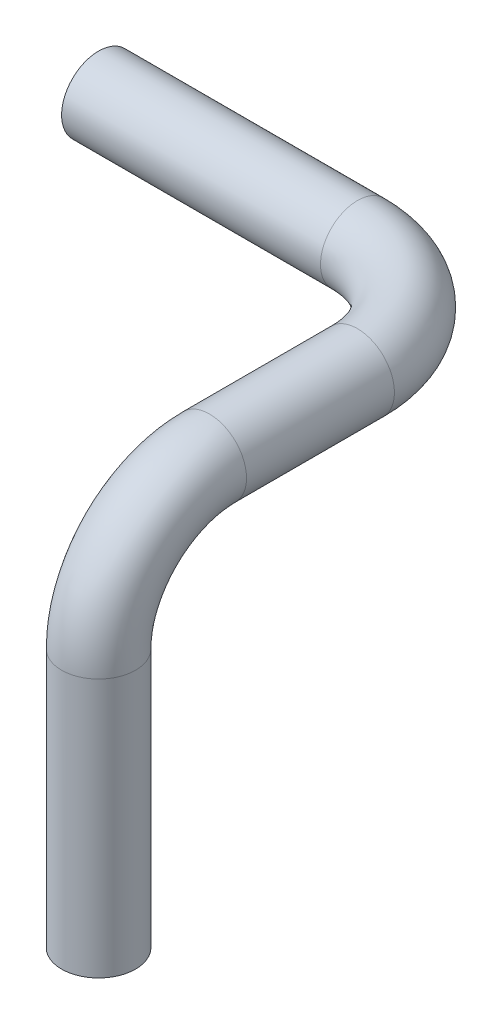
ISO-10303-21;
HEADER;
FILE_DESCRIPTION(('STEP AP214'),'2;1');
FILE_NAME('part.step','',(''),(''),'','','');
FILE_SCHEMA(('AUTOMOTIVE_DESIGN { 1 0 10303 214 1 1 1 1 }'));
ENDSEC;
DATA;
#1=APPLICATION_CONTEXT('core data for automotive mechanical design processes');
#2=APPLICATION_PROTOCOL_DEFINITION('international standard','automotive_design',2000,#1);
#3=PRODUCT_CONTEXT('',#1,'mechanical');
#4=PRODUCT('Part','Part','',(#3));
#5=PRODUCT_RELATED_PRODUCT_CATEGORY('part','',(#4));
#6=PRODUCT_DEFINITION_FORMATION('','',#4);
#7=PRODUCT_DEFINITION_CONTEXT('part definition',#1,'design');
#8=PRODUCT_DEFINITION('design','',#6,#7);
#9=PRODUCT_DEFINITION_SHAPE('','',#8);
#10=(LENGTH_UNIT() NAMED_UNIT(*) SI_UNIT(.MILLI.,.METRE.));
#11=(NAMED_UNIT(*) PLANE_ANGLE_UNIT() SI_UNIT($,.RADIAN.));
#12=(NAMED_UNIT(*) SI_UNIT($,.STERADIAN.) SOLID_ANGLE_UNIT());
#13=UNCERTAINTY_MEASURE_WITH_UNIT(LENGTH_MEASURE(1.E-05),#10,'distance_accuracy_value','');
#14=(GEOMETRIC_REPRESENTATION_CONTEXT(3) GLOBAL_UNCERTAINTY_ASSIGNED_CONTEXT((#13)) GLOBAL_UNIT_ASSIGNED_CONTEXT((#10,
#11,#12)) REPRESENTATION_CONTEXT('',''));
#15=CARTESIAN_POINT('',(0.,0.,0.));
#16=DIRECTION('',(0.,0.,1.));
#17=DIRECTION('',(1.,0.,0.));
#18=AXIS2_PLACEMENT_3D('',#15,#16,#17);
#19=CARTESIAN_POINT('',(0.,254.,0.));
#20=DIRECTION('',(1.,0.,0.));
#21=DIRECTION('',(0.,0.,-1.));
#22=AXIS2_PLACEMENT_3D('',#19,#20,#21);
#23=PLANE('',#22);
#24=CARTESIAN_POINT('',(0.,254.,0.));
#25=DIRECTION('',(1.,0.,0.));
#26=DIRECTION('',(0.,0.,-1.));
#27=AXIS2_PLACEMENT_3D('',#24,#25,#26);
#28=CIRCLE('',#27,22.86);
#29=CARTESIAN_POINT('',(0.,254.,-22.86));
#30=VERTEX_POINT('',#29);
#31=EDGE_CURVE('E99',#30,#30,#28,.T.);
#32=ORIENTED_EDGE('',*,*,#31,.T.);
#33=EDGE_LOOP('',(#32));
#34=FACE_BOUND('',#33,.T.);
#35=CARTESIAN_POINT('',(0.,254.,0.));
#36=DIRECTION('',(1.,0.,0.));
#37=DIRECTION('',(0.,0.,-1.));
#38=AXIS2_PLACEMENT_3D('',#35,#36,#37);
#39=CIRCLE('',#38,25.4);
#40=CARTESIAN_POINT('',(0.,254.,-25.4));
#41=VERTEX_POINT('',#40);
#42=EDGE_CURVE('E64',#41,#41,#39,.T.);
#43=ORIENTED_EDGE('',*,*,#42,.F.);
#44=EDGE_LOOP('',(#43));
#45=FACE_BOUND('',#44,.T.);
#46=ADVANCED_FACE('F51',(#34,#45),#23,.F.);
#47=CARTESIAN_POINT('',(254.,0.,254.));
#48=DIRECTION('',(0.,-1.,0.));
#49=DIRECTION('',(1.,0.,0.));
#50=AXIS2_PLACEMENT_3D('',#47,#48,#49);
#51=PLANE('',#50);
#52=CARTESIAN_POINT('',(254.,0.,254.));
#53=DIRECTION('',(0.,-1.,0.));
#54=DIRECTION('',(0.,0.,-1.));
#55=AXIS2_PLACEMENT_3D('',#52,#53,#54);
#56=CIRCLE('',#55,22.86);
#57=CARTESIAN_POINT('',(254.,0.,231.14));
#58=VERTEX_POINT('',#57);
#59=EDGE_CURVE('E94',#58,#58,#56,.T.);
#60=ORIENTED_EDGE('',*,*,#59,.F.);
#61=EDGE_LOOP('',(#60));
#62=FACE_BOUND('',#61,.T.);
#63=CARTESIAN_POINT('',(254.,0.,254.));
#64=DIRECTION('',(0.,-1.,0.));
#65=DIRECTION('',(1.,0.,0.));
#66=AXIS2_PLACEMENT_3D('',#63,#64,#65);
#67=CIRCLE('',#66,25.4);
#68=CARTESIAN_POINT('',(279.4,0.,254.));
#69=VERTEX_POINT('',#68);
#70=EDGE_CURVE('E12',#69,#69,#67,.T.);
#71=ORIENTED_EDGE('',*,*,#70,.T.);
#72=EDGE_LOOP('',(#71));
#73=FACE_BOUND('',#72,.T.);
#74=ADVANCED_FACE('F67',(#62,#73),#51,.T.);
#75=CARTESIAN_POINT('',(0.,254.,0.));
#76=DIRECTION('',(1.,0.,0.));
#77=DIRECTION('',(0.,0.,-1.));
#78=AXIS2_PLACEMENT_3D('',#75,#76,#77);
#79=CYLINDRICAL_SURFACE('',#78,25.4);
#80=CARTESIAN_POINT('',(177.8,254.,0.));
#81=DIRECTION('',(1.,0.,0.));
#82=DIRECTION('',(0.,0.,-1.));
#83=AXIS2_PLACEMENT_3D('',#80,#81,#82);
#84=CIRCLE('',#83,25.4);
#85=CARTESIAN_POINT('',(177.8,254.,-25.4));
#86=VERTEX_POINT('',#85);
#87=EDGE_CURVE('E88',#86,#86,#84,.T.);
#88=ORIENTED_EDGE('',*,*,#87,.F.);
#89=EDGE_LOOP('',(#88));
#90=FACE_BOUND('',#89,.T.);
#91=ORIENTED_EDGE('',*,*,#42,.T.);
#92=EDGE_LOOP('',(#91));
#93=FACE_BOUND('',#92,.T.);
#94=ADVANCED_FACE('F142',(#90,#93),#79,.T.);
#95=CARTESIAN_POINT('',(177.8,254.,76.2));
#96=DIRECTION('',(0.,-1.,0.));
#97=DIRECTION('',(0.,0.,-1.));
#98=AXIS2_PLACEMENT_3D('',#95,#96,#97);
#99=TOROIDAL_SURFACE('',#98,76.2,25.4);
#100=CARTESIAN_POINT('',(254.,254.,76.2));
#101=DIRECTION('',(0.,0.,1.));
#102=DIRECTION('',(1.,0.,0.));
#103=AXIS2_PLACEMENT_3D('',#100,#101,#102);
#104=CIRCLE('',#103,25.4);
#105=CARTESIAN_POINT('',(279.4,254.,76.2));
#106=VERTEX_POINT('',#105);
#107=EDGE_CURVE('E82',#106,#106,#104,.T.);
#108=CARTESIAN_POINT('',(177.8,254.,76.2));
#109=DIRECTION('',(0.,-1.,0.));
#110=DIRECTION('',(0.,0.,-1.));
#111=AXIS2_PLACEMENT_3D('',#108,#109,#110);
#112=CIRCLE('',#111,101.6);
#113=EDGE_CURVE('',#86,#106,#112,.T.);
#114=ORIENTED_EDGE('',*,*,#87,.T.);
#115=ORIENTED_EDGE('',*,*,#107,.F.);
#116=ORIENTED_EDGE('',*,*,#113,.T.);
#117=ORIENTED_EDGE('',*,*,#113,.F.);
#118=EDGE_LOOP('',(#114,#116,#115,#117));
#119=FACE_BOUND('',#118,.T.);
#120=ADVANCED_FACE('F145',(#119),#99,.T.);
#121=CARTESIAN_POINT('',(254.,254.,76.2));
#122=DIRECTION('',(0.,0.,1.));
#123=DIRECTION('',(1.,0.,0.));
#124=AXIS2_PLACEMENT_3D('',#121,#122,#123);
#125=CYLINDRICAL_SURFACE('',#124,25.4);
#126=CARTESIAN_POINT('',(254.,254.,177.8));
#127=DIRECTION('',(0.,0.,1.));
#128=DIRECTION('',(1.,0.,0.));
#129=AXIS2_PLACEMENT_3D('',#126,#127,#128);
#130=CIRCLE('',#129,25.4);
#131=CARTESIAN_POINT('',(254.,279.4,177.8));
#132=VERTEX_POINT('',#131);
#133=EDGE_CURVE('E79',#132,#132,#130,.T.);
#134=ORIENTED_EDGE('',*,*,#133,.F.);
#135=EDGE_LOOP('',(#134));
#136=FACE_BOUND('',#135,.T.);
#137=ORIENTED_EDGE('',*,*,#107,.T.);
#138=EDGE_LOOP('',(#137));
#139=FACE_BOUND('',#138,.T.);
#140=ADVANCED_FACE('F149',(#136,#139),#125,.T.);
#141=CARTESIAN_POINT('',(254.,177.8,177.8));
#142=DIRECTION('',(1.,0.,0.));
#143=DIRECTION('',(0.,0.,-1.));
#144=AXIS2_PLACEMENT_3D('',#141,#142,#143);
#145=TOROIDAL_SURFACE('',#144,76.2,25.4);
#146=CARTESIAN_POINT('',(254.,177.8,254.));
#147=DIRECTION('',(0.,-1.,0.));
#148=DIRECTION('',(1.,0.,0.));
#149=AXIS2_PLACEMENT_3D('',#146,#147,#148);
#150=CIRCLE('',#149,25.4);
#151=CARTESIAN_POINT('',(254.,177.8,279.4));
#152=VERTEX_POINT('',#151);
#153=EDGE_CURVE('E59',#152,#152,#150,.T.);
#154=CARTESIAN_POINT('',(254.,177.8,177.8));
#155=DIRECTION('',(1.,0.,0.));
#156=DIRECTION('',(0.,0.,-1.));
#157=AXIS2_PLACEMENT_3D('',#154,#155,#156);
#158=CIRCLE('',#157,101.6);
#159=EDGE_CURVE('',#132,#152,#158,.T.);
#160=ORIENTED_EDGE('',*,*,#133,.T.);
#161=ORIENTED_EDGE('',*,*,#153,.F.);
#162=ORIENTED_EDGE('',*,*,#159,.T.);
#163=ORIENTED_EDGE('',*,*,#159,.F.);
#164=EDGE_LOOP('',(#160,#162,#161,#163));
#165=FACE_BOUND('',#164,.T.);
#166=ADVANCED_FACE('F73',(#165),#145,.T.);
#167=CARTESIAN_POINT('',(254.,177.8,254.));
#168=DIRECTION('',(0.,-1.,0.));
#169=DIRECTION('',(0.,0.,-1.));
#170=AXIS2_PLACEMENT_3D('',#167,#168,#169);
#171=CYLINDRICAL_SURFACE('',#170,25.4);
#172=ORIENTED_EDGE('',*,*,#70,.F.);
#173=EDGE_LOOP('',(#172));
#174=FACE_BOUND('',#173,.T.);
#175=ORIENTED_EDGE('',*,*,#153,.T.);
#176=EDGE_LOOP('',(#175));
#177=FACE_BOUND('',#176,.T.);
#178=ADVANCED_FACE('F69',(#174,#177),#171,.T.);
#179=CARTESIAN_POINT('',(0.,254.,0.));
#180=DIRECTION('',(1.,0.,0.));
#181=DIRECTION('',(0.,0.,-1.));
#182=AXIS2_PLACEMENT_3D('',#179,#180,#181);
#183=CYLINDRICAL_SURFACE('',#182,22.86);
#184=CARTESIAN_POINT('',(177.8,254.,0.));
#185=DIRECTION('',(-1.,0.,0.));
#186=DIRECTION('',(0.,0.,1.));
#187=AXIS2_PLACEMENT_3D('',#184,#185,#186);
#188=CIRCLE('',#187,22.86);
#189=CARTESIAN_POINT('',(177.8,254.,-22.86));
#190=VERTEX_POINT('',#189);
#191=EDGE_CURVE('E103',#190,#190,#188,.F.);
#192=ORIENTED_EDGE('',*,*,#191,.T.);
#193=EDGE_LOOP('',(#192));
#194=FACE_BOUND('',#193,.T.);
#195=ORIENTED_EDGE('',*,*,#31,.F.);
#196=EDGE_LOOP('',(#195));
#197=FACE_BOUND('',#196,.T.);
#198=ADVANCED_FACE('F72',(#194,#197),#183,.F.);
#199=CARTESIAN_POINT('',(177.8,254.,76.2));
#200=DIRECTION('',(0.,-1.,0.));
#201=DIRECTION('',(0.,0.,-1.));
#202=AXIS2_PLACEMENT_3D('',#199,#200,#201);
#203=TOROIDAL_SURFACE('',#202,76.2,22.86);
#204=CARTESIAN_POINT('',(254.,254.,76.2));
#205=DIRECTION('',(0.,0.,1.));
#206=DIRECTION('',(1.,0.,0.));
#207=AXIS2_PLACEMENT_3D('',#204,#205,#206);
#208=CIRCLE('',#207,22.86);
#209=CARTESIAN_POINT('',(276.86,254.,76.2));
#210=VERTEX_POINT('',#209);
#211=EDGE_CURVE('E111',#210,#210,#208,.T.);
#212=CARTESIAN_POINT('',(177.8,254.,76.2));
#213=DIRECTION('',(0.,-1.,0.));
#214=DIRECTION('',(0.,0.,-1.));
#215=AXIS2_PLACEMENT_3D('',#212,#213,#214);
#216=CIRCLE('',#215,99.06);
#217=EDGE_CURVE('',#190,#210,#216,.T.);
#218=ORIENTED_EDGE('',*,*,#191,.F.);
#219=ORIENTED_EDGE('',*,*,#211,.T.);
#220=ORIENTED_EDGE('',*,*,#217,.T.);
#221=ORIENTED_EDGE('',*,*,#217,.F.);
#222=EDGE_LOOP('',(#218,#220,#219,#221));
#223=FACE_BOUND('',#222,.T.);
#224=ADVANCED_FACE('F121',(#223),#203,.F.);
#225=CARTESIAN_POINT('',(254.,254.,76.2));
#226=DIRECTION('',(0.,0.,1.));
#227=DIRECTION('',(1.,0.,0.));
#228=AXIS2_PLACEMENT_3D('',#225,#226,#227);
#229=CYLINDRICAL_SURFACE('',#228,22.86);
#230=CARTESIAN_POINT('',(254.,254.,177.8));
#231=DIRECTION('',(0.,0.,-1.));
#232=DIRECTION('',(0.,1.,0.));
#233=AXIS2_PLACEMENT_3D('',#230,#231,#232);
#234=CIRCLE('',#233,22.86);
#235=CARTESIAN_POINT('',(254.,276.86,177.8));
#236=VERTEX_POINT('',#235);
#237=EDGE_CURVE('E107',#236,#236,#234,.F.);
#238=ORIENTED_EDGE('',*,*,#237,.T.);
#239=EDGE_LOOP('',(#238));
#240=FACE_BOUND('',#239,.T.);
#241=ORIENTED_EDGE('',*,*,#211,.F.);
#242=EDGE_LOOP('',(#241));
#243=FACE_BOUND('',#242,.T.);
#244=ADVANCED_FACE('F123',(#240,#243),#229,.F.);
#245=CARTESIAN_POINT('',(254.,177.8,177.8));
#246=DIRECTION('',(1.,0.,0.));
#247=DIRECTION('',(0.,0.,-1.));
#248=AXIS2_PLACEMENT_3D('',#245,#246,#247);
#249=TOROIDAL_SURFACE('',#248,76.2,22.86);
#250=CARTESIAN_POINT('',(254.,177.8,254.));
#251=DIRECTION('',(0.,-1.,0.));
#252=DIRECTION('',(0.,0.,-1.));
#253=AXIS2_PLACEMENT_3D('',#250,#251,#252);
#254=CIRCLE('',#253,22.86);
#255=CARTESIAN_POINT('',(254.,177.8,276.86));
#256=VERTEX_POINT('',#255);
#257=EDGE_CURVE('E98',#256,#256,#254,.T.);
#258=CARTESIAN_POINT('',(254.,177.8,177.8));
#259=DIRECTION('',(1.,0.,0.));
#260=DIRECTION('',(0.,0.,-1.));
#261=AXIS2_PLACEMENT_3D('',#258,#259,#260);
#262=CIRCLE('',#261,99.06);
#263=EDGE_CURVE('',#236,#256,#262,.T.);
#264=ORIENTED_EDGE('',*,*,#237,.F.);
#265=ORIENTED_EDGE('',*,*,#257,.T.);
#266=ORIENTED_EDGE('',*,*,#263,.T.);
#267=ORIENTED_EDGE('',*,*,#263,.F.);
#268=EDGE_LOOP('',(#264,#266,#265,#267));
#269=FACE_BOUND('',#268,.T.);
#270=ADVANCED_FACE('F130',(#269),#249,.F.);
#271=CARTESIAN_POINT('',(254.,177.8,254.));
#272=DIRECTION('',(0.,-1.,0.));
#273=DIRECTION('',(0.,0.,-1.));
#274=AXIS2_PLACEMENT_3D('',#271,#272,#273);
#275=CYLINDRICAL_SURFACE('',#274,22.86);
#276=ORIENTED_EDGE('',*,*,#59,.T.);
#277=EDGE_LOOP('',(#276));
#278=FACE_BOUND('',#277,.T.);
#279=ORIENTED_EDGE('',*,*,#257,.F.);
#280=EDGE_LOOP('',(#279));
#281=FACE_BOUND('',#280,.T.);
#282=ADVANCED_FACE('F137',(#278,#281),#275,.F.);
#283=CLOSED_SHELL('',(#46,#74,#94,#120,#140,#166,#178,#198,#224,#244,#270,#282));
#284=MANIFOLD_SOLID_BREP('B2',#283);
#285=ADVANCED_BREP_SHAPE_REPRESENTATION('',(#18,#284),#14);
#286=SHAPE_DEFINITION_REPRESENTATION(#9,#285);
ENDSEC;
END-ISO-10303-21;
